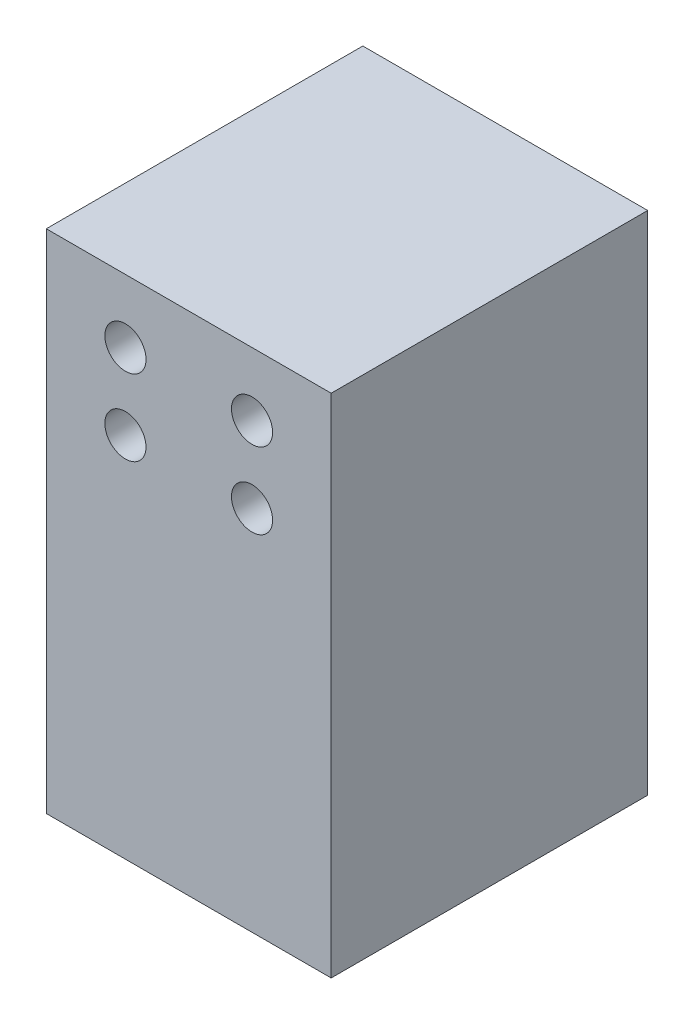
ISO-10303-21;
HEADER;
FILE_DESCRIPTION(('STEP AP214'),'2;1');
FILE_NAME('part.step','',(''),(''),'','','');
FILE_SCHEMA(('AUTOMOTIVE_DESIGN { 1 0 10303 214 1 1 1 1 }'));
ENDSEC;
DATA;
#1=APPLICATION_CONTEXT('core data for automotive mechanical design processes');
#2=APPLICATION_PROTOCOL_DEFINITION('international standard','automotive_design',2000,#1);
#3=PRODUCT_CONTEXT('',#1,'mechanical');
#4=PRODUCT('Part','Part','',(#3));
#5=PRODUCT_RELATED_PRODUCT_CATEGORY('part','',(#4));
#6=PRODUCT_DEFINITION_FORMATION('','',#4);
#7=PRODUCT_DEFINITION_CONTEXT('part definition',#1,'design');
#8=PRODUCT_DEFINITION('design','',#6,#7);
#9=PRODUCT_DEFINITION_SHAPE('','',#8);
#10=(LENGTH_UNIT() NAMED_UNIT(*) SI_UNIT(.MILLI.,.METRE.));
#11=(NAMED_UNIT(*) PLANE_ANGLE_UNIT() SI_UNIT($,.RADIAN.));
#12=(NAMED_UNIT(*) SI_UNIT($,.STERADIAN.) SOLID_ANGLE_UNIT());
#13=UNCERTAINTY_MEASURE_WITH_UNIT(LENGTH_MEASURE(1.E-05),#10,'distance_accuracy_value','');
#14=(GEOMETRIC_REPRESENTATION_CONTEXT(3) GLOBAL_UNCERTAINTY_ASSIGNED_CONTEXT((#13)) GLOBAL_UNIT_ASSIGNED_CONTEXT((#10,
#11,#12)) REPRESENTATION_CONTEXT('',''));
#15=CARTESIAN_POINT('',(0.,0.,0.));
#16=DIRECTION('',(0.,0.,1.));
#17=DIRECTION('',(1.,0.,0.));
#18=AXIS2_PLACEMENT_3D('',#15,#16,#17);
#19=CARTESIAN_POINT('',(22.5,-40.,25.));
#20=DIRECTION('',(-1.,0.,0.));
#21=DIRECTION('',(0.,0.,1.));
#22=AXIS2_PLACEMENT_3D('',#19,#20,#21);
#23=PLANE('',#22);
#24=DIRECTION('',(0.,1.,0.));
#25=VECTOR('',#24,1.);
#26=CARTESIAN_POINT('',(22.5,-40.,-25.));
#27=LINE('',#26,#25);
#28=CARTESIAN_POINT('',(22.5,-40.,-25.));
#29=VERTEX_POINT('',#28);
#30=CARTESIAN_POINT('',(22.5,40.,-25.));
#31=VERTEX_POINT('',#30);
#32=EDGE_CURVE('E95',#29,#31,#27,.T.);
#33=ORIENTED_EDGE('',*,*,#32,.T.);
#34=DIRECTION('',(0.,0.,-1.));
#35=VECTOR('',#34,1.);
#36=CARTESIAN_POINT('',(22.5,40.,25.));
#37=LINE('',#36,#35);
#38=CARTESIAN_POINT('',(22.5,40.,25.));
#39=VERTEX_POINT('',#38);
#40=EDGE_CURVE('E11',#39,#31,#37,.T.);
#41=ORIENTED_EDGE('',*,*,#40,.F.);
#42=DIRECTION('',(0.,1.,0.));
#43=VECTOR('',#42,1.);
#44=CARTESIAN_POINT('',(22.5,-40.,25.));
#45=LINE('',#44,#43);
#46=CARTESIAN_POINT('',(22.5,-40.,25.));
#47=VERTEX_POINT('',#46);
#48=EDGE_CURVE('E83',#47,#39,#45,.T.);
#49=ORIENTED_EDGE('',*,*,#48,.F.);
#50=DIRECTION('',(0.,0.,-1.));
#51=VECTOR('',#50,1.);
#52=CARTESIAN_POINT('',(22.5,-40.,25.));
#53=LINE('',#52,#51);
#54=EDGE_CURVE('E91',#47,#29,#53,.T.);
#55=ORIENTED_EDGE('',*,*,#54,.T.);
#56=EDGE_LOOP('',(#33,#41,#49,#55));
#57=FACE_BOUND('',#56,.T.);
#58=ADVANCED_FACE('F32',(#57),#23,.F.);
#59=CARTESIAN_POINT('',(-22.5,40.,25.));
#60=DIRECTION('',(0.,-1.,0.));
#61=DIRECTION('',(0.,0.,-1.));
#62=AXIS2_PLACEMENT_3D('',#59,#60,#61);
#63=PLANE('',#62);
#64=DIRECTION('',(-1.,0.,0.));
#65=VECTOR('',#64,1.);
#66=CARTESIAN_POINT('',(-22.5,40.,-25.));
#67=LINE('',#66,#65);
#68=CARTESIAN_POINT('',(-22.5,40.,-25.));
#69=VERTEX_POINT('',#68);
#70=EDGE_CURVE('E87',#31,#69,#67,.T.);
#71=ORIENTED_EDGE('',*,*,#70,.T.);
#72=DIRECTION('',(0.,0.,-1.));
#73=VECTOR('',#72,1.);
#74=CARTESIAN_POINT('',(-22.5,40.,25.));
#75=LINE('',#74,#73);
#76=CARTESIAN_POINT('',(-22.5,40.,25.));
#77=VERTEX_POINT('',#76);
#78=EDGE_CURVE('E40',#77,#69,#75,.T.);
#79=ORIENTED_EDGE('',*,*,#78,.F.);
#80=DIRECTION('',(-1.,0.,0.));
#81=VECTOR('',#80,1.);
#82=CARTESIAN_POINT('',(-22.5,40.,25.));
#83=LINE('',#82,#81);
#84=EDGE_CURVE('E78',#39,#77,#83,.T.);
#85=ORIENTED_EDGE('',*,*,#84,.F.);
#86=ORIENTED_EDGE('',*,*,#40,.T.);
#87=EDGE_LOOP('',(#71,#79,#85,#86));
#88=FACE_BOUND('',#87,.T.);
#89=ADVANCED_FACE('F86',(#88),#63,.F.);
#90=CARTESIAN_POINT('',(-22.5,-40.,25.));
#91=DIRECTION('',(1.,0.,0.));
#92=DIRECTION('',(0.,0.,-1.));
#93=AXIS2_PLACEMENT_3D('',#90,#91,#92);
#94=PLANE('',#93);
#95=DIRECTION('',(0.,-1.,0.));
#96=VECTOR('',#95,1.);
#97=CARTESIAN_POINT('',(-22.5,-40.,-25.));
#98=LINE('',#97,#96);
#99=CARTESIAN_POINT('',(-22.5,-40.,-25.));
#100=VERTEX_POINT('',#99);
#101=EDGE_CURVE('E65',#69,#100,#98,.T.);
#102=ORIENTED_EDGE('',*,*,#101,.T.);
#103=DIRECTION('',(0.,0.,-1.));
#104=VECTOR('',#103,1.);
#105=CARTESIAN_POINT('',(-22.5,-40.,25.));
#106=LINE('',#105,#104);
#107=CARTESIAN_POINT('',(-22.5,-40.,25.));
#108=VERTEX_POINT('',#107);
#109=EDGE_CURVE('E88',#108,#100,#106,.T.);
#110=ORIENTED_EDGE('',*,*,#109,.F.);
#111=DIRECTION('',(0.,-1.,0.));
#112=VECTOR('',#111,1.);
#113=CARTESIAN_POINT('',(-22.5,-40.,25.));
#114=LINE('',#113,#112);
#115=EDGE_CURVE('E81',#77,#108,#114,.T.);
#116=ORIENTED_EDGE('',*,*,#115,.F.);
#117=ORIENTED_EDGE('',*,*,#78,.T.);
#118=EDGE_LOOP('',(#102,#110,#116,#117));
#119=FACE_BOUND('',#118,.T.);
#120=ADVANCED_FACE('F89',(#119),#94,.F.);
#121=CARTESIAN_POINT('',(-22.5,-40.,25.));
#122=DIRECTION('',(0.,1.,0.));
#123=DIRECTION('',(0.,0.,1.));
#124=AXIS2_PLACEMENT_3D('',#121,#122,#123);
#125=PLANE('',#124);
#126=CARTESIAN_POINT('',(-12.,-40.,-17.5));
#127=DIRECTION('',(0.,-1.,0.));
#128=DIRECTION('',(0.,0.,-1.));
#129=AXIS2_PLACEMENT_3D('',#126,#127,#128);
#130=CIRCLE('',#129,2.25);
#131=CARTESIAN_POINT('',(-12.,-40.,-19.75));
#132=VERTEX_POINT('',#131);
#133=EDGE_CURVE('E142',#132,#132,#130,.T.);
#134=ORIENTED_EDGE('',*,*,#133,.F.);
#135=EDGE_LOOP('',(#134));
#136=FACE_BOUND('',#135,.T.);
#137=CARTESIAN_POINT('',(12.,-40.,-17.5));
#138=DIRECTION('',(0.,-1.,0.));
#139=DIRECTION('',(0.,0.,-1.));
#140=AXIS2_PLACEMENT_3D('',#137,#138,#139);
#141=CIRCLE('',#140,2.25);
#142=CARTESIAN_POINT('',(12.,-40.,-19.75));
#143=VERTEX_POINT('',#142);
#144=EDGE_CURVE('E148',#143,#143,#141,.T.);
#145=ORIENTED_EDGE('',*,*,#144,.F.);
#146=EDGE_LOOP('',(#145));
#147=FACE_BOUND('',#146,.T.);
#148=CARTESIAN_POINT('',(12.,-40.,17.5));
#149=DIRECTION('',(0.,-1.,0.));
#150=DIRECTION('',(0.,0.,-1.));
#151=AXIS2_PLACEMENT_3D('',#148,#149,#150);
#152=CIRCLE('',#151,2.25);
#153=CARTESIAN_POINT('',(12.,-40.,15.25));
#154=VERTEX_POINT('',#153);
#155=EDGE_CURVE('E136',#154,#154,#152,.T.);
#156=ORIENTED_EDGE('',*,*,#155,.F.);
#157=EDGE_LOOP('',(#156));
#158=FACE_BOUND('',#157,.T.);
#159=CARTESIAN_POINT('',(-12.,-40.,17.5));
#160=DIRECTION('',(0.,-1.,0.));
#161=DIRECTION('',(0.,0.,-1.));
#162=AXIS2_PLACEMENT_3D('',#159,#160,#161);
#163=CIRCLE('',#162,2.25);
#164=CARTESIAN_POINT('',(-12.,-40.,15.25));
#165=VERTEX_POINT('',#164);
#166=EDGE_CURVE('E133',#165,#165,#163,.T.);
#167=ORIENTED_EDGE('',*,*,#166,.F.);
#168=EDGE_LOOP('',(#167));
#169=FACE_BOUND('',#168,.T.);
#170=DIRECTION('',(1.,0.,0.));
#171=VECTOR('',#170,1.);
#172=CARTESIAN_POINT('',(-22.5,-40.,-25.));
#173=LINE('',#172,#171);
#174=EDGE_CURVE('E71',#100,#29,#173,.T.);
#175=ORIENTED_EDGE('',*,*,#174,.T.);
#176=ORIENTED_EDGE('',*,*,#54,.F.);
#177=DIRECTION('',(1.,0.,0.));
#178=VECTOR('',#177,1.);
#179=CARTESIAN_POINT('',(-22.5,-40.,25.));
#180=LINE('',#179,#178);
#181=EDGE_CURVE('E48',#108,#47,#180,.T.);
#182=ORIENTED_EDGE('',*,*,#181,.F.);
#183=ORIENTED_EDGE('',*,*,#109,.T.);
#184=EDGE_LOOP('',(#175,#176,#182,#183));
#185=FACE_BOUND('',#184,.T.);
#186=ADVANCED_FACE('F103',(#136,#147,#158,#169,#185),#125,.F.);
#187=CARTESIAN_POINT('',(0.,0.,25.));
#188=DIRECTION('',(0.,0.,-1.));
#189=DIRECTION('',(-1.,0.,0.));
#190=AXIS2_PLACEMENT_3D('',#187,#188,#189);
#191=PLANE('',#190);
#192=CARTESIAN_POINT('',(-9.99999999999999,18.,25.));
#193=DIRECTION('',(0.,0.,1.));
#194=DIRECTION('',(1.,0.,0.));
#195=AXIS2_PLACEMENT_3D('',#192,#193,#194);
#196=CIRCLE('',#195,3.25);
#197=CARTESIAN_POINT('',(-6.74999999999999,18.,25.));
#198=VERTEX_POINT('',#197);
#199=EDGE_CURVE('E124',#198,#198,#196,.T.);
#200=ORIENTED_EDGE('',*,*,#199,.F.);
#201=EDGE_LOOP('',(#200));
#202=FACE_BOUND('',#201,.T.);
#203=CARTESIAN_POINT('',(9.99999999999999,18.,25.));
#204=DIRECTION('',(0.,0.,1.));
#205=DIRECTION('',(1.,0.,0.));
#206=AXIS2_PLACEMENT_3D('',#203,#204,#205);
#207=CIRCLE('',#206,3.25);
#208=CARTESIAN_POINT('',(13.25,18.,25.));
#209=VERTEX_POINT('',#208);
#210=EDGE_CURVE('E125',#209,#209,#207,.T.);
#211=ORIENTED_EDGE('',*,*,#210,.F.);
#212=EDGE_LOOP('',(#211));
#213=FACE_BOUND('',#212,.T.);
#214=CARTESIAN_POINT('',(-9.99999999999999,30.,25.));
#215=DIRECTION('',(0.,0.,1.));
#216=DIRECTION('',(1.,0.,0.));
#217=AXIS2_PLACEMENT_3D('',#214,#215,#216);
#218=CIRCLE('',#217,3.25);
#219=CARTESIAN_POINT('',(-6.74999999999999,30.,25.));
#220=VERTEX_POINT('',#219);
#221=EDGE_CURVE('E112',#220,#220,#218,.T.);
#222=ORIENTED_EDGE('',*,*,#221,.F.);
#223=EDGE_LOOP('',(#222));
#224=FACE_BOUND('',#223,.T.);
#225=CARTESIAN_POINT('',(9.99999999999999,30.,25.));
#226=DIRECTION('',(0.,0.,1.));
#227=DIRECTION('',(1.,0.,0.));
#228=AXIS2_PLACEMENT_3D('',#225,#226,#227);
#229=CIRCLE('',#228,3.25);
#230=CARTESIAN_POINT('',(13.25,30.,25.));
#231=VERTEX_POINT('',#230);
#232=EDGE_CURVE('E109',#231,#231,#229,.T.);
#233=ORIENTED_EDGE('',*,*,#232,.F.);
#234=EDGE_LOOP('',(#233));
#235=FACE_BOUND('',#234,.T.);
#236=ORIENTED_EDGE('',*,*,#48,.T.);
#237=ORIENTED_EDGE('',*,*,#84,.T.);
#238=ORIENTED_EDGE('',*,*,#115,.T.);
#239=ORIENTED_EDGE('',*,*,#181,.T.);
#240=EDGE_LOOP('',(#236,#237,#238,#239));
#241=FACE_BOUND('',#240,.T.);
#242=ADVANCED_FACE('F79',(#202,#213,#224,#235,#241),#191,.F.);
#243=CARTESIAN_POINT('',(0.,0.,-25.));
#244=DIRECTION('',(0.,0.,-1.));
#245=DIRECTION('',(-1.,0.,0.));
#246=AXIS2_PLACEMENT_3D('',#243,#244,#245);
#247=PLANE('',#246);
#248=CARTESIAN_POINT('',(-9.99999999999999,18.,-25.));
#249=DIRECTION('',(0.,0.,1.));
#250=DIRECTION('',(1.,0.,0.));
#251=AXIS2_PLACEMENT_3D('',#248,#249,#250);
#252=CIRCLE('',#251,3.25);
#253=CARTESIAN_POINT('',(-6.74999999999999,18.,-25.));
#254=VERTEX_POINT('',#253);
#255=EDGE_CURVE('E116',#254,#254,#252,.T.);
#256=ORIENTED_EDGE('',*,*,#255,.T.);
#257=EDGE_LOOP('',(#256));
#258=FACE_BOUND('',#257,.T.);
#259=CARTESIAN_POINT('',(9.99999999999999,18.,-25.));
#260=DIRECTION('',(0.,0.,1.));
#261=DIRECTION('',(1.,0.,0.));
#262=AXIS2_PLACEMENT_3D('',#259,#260,#261);
#263=CIRCLE('',#262,3.25);
#264=CARTESIAN_POINT('',(13.25,18.,-25.));
#265=VERTEX_POINT('',#264);
#266=EDGE_CURVE('E121',#265,#265,#263,.T.);
#267=ORIENTED_EDGE('',*,*,#266,.T.);
#268=EDGE_LOOP('',(#267));
#269=FACE_BOUND('',#268,.T.);
#270=CARTESIAN_POINT('',(-9.99999999999999,30.,-25.));
#271=DIRECTION('',(0.,0.,1.));
#272=DIRECTION('',(1.,0.,0.));
#273=AXIS2_PLACEMENT_3D('',#270,#271,#272);
#274=CIRCLE('',#273,3.25);
#275=CARTESIAN_POINT('',(-6.74999999999999,30.,-25.));
#276=VERTEX_POINT('',#275);
#277=EDGE_CURVE('E98',#276,#276,#274,.T.);
#278=ORIENTED_EDGE('',*,*,#277,.T.);
#279=EDGE_LOOP('',(#278));
#280=FACE_BOUND('',#279,.T.);
#281=CARTESIAN_POINT('',(9.99999999999999,30.,-25.));
#282=DIRECTION('',(0.,0.,1.));
#283=DIRECTION('',(1.,0.,0.));
#284=AXIS2_PLACEMENT_3D('',#281,#282,#283);
#285=CIRCLE('',#284,3.25);
#286=CARTESIAN_POINT('',(13.25,30.,-25.));
#287=VERTEX_POINT('',#286);
#288=EDGE_CURVE('E113',#287,#287,#285,.T.);
#289=ORIENTED_EDGE('',*,*,#288,.T.);
#290=EDGE_LOOP('',(#289));
#291=FACE_BOUND('',#290,.T.);
#292=ORIENTED_EDGE('',*,*,#32,.F.);
#293=ORIENTED_EDGE('',*,*,#174,.F.);
#294=ORIENTED_EDGE('',*,*,#101,.F.);
#295=ORIENTED_EDGE('',*,*,#70,.F.);
#296=EDGE_LOOP('',(#292,#293,#294,#295));
#297=FACE_BOUND('',#296,.T.);
#298=ADVANCED_FACE('F106',(#258,#269,#280,#291,#297),#247,.T.);
#299=CARTESIAN_POINT('',(9.99999999999999,30.,-25.));
#300=DIRECTION('',(0.,0.,1.));
#301=DIRECTION('',(1.,0.,0.));
#302=AXIS2_PLACEMENT_3D('',#299,#300,#301);
#303=CYLINDRICAL_SURFACE('',#302,3.25);
#304=ORIENTED_EDGE('',*,*,#288,.F.);
#305=EDGE_LOOP('',(#304));
#306=FACE_BOUND('',#305,.T.);
#307=ORIENTED_EDGE('',*,*,#232,.T.);
#308=EDGE_LOOP('',(#307));
#309=FACE_BOUND('',#308,.T.);
#310=ADVANCED_FACE('F192',(#306,#309),#303,.F.);
#311=CARTESIAN_POINT('',(-9.99999999999999,30.,-25.));
#312=DIRECTION('',(0.,0.,1.));
#313=DIRECTION('',(1.,0.,0.));
#314=AXIS2_PLACEMENT_3D('',#311,#312,#313);
#315=CYLINDRICAL_SURFACE('',#314,3.25);
#316=ORIENTED_EDGE('',*,*,#277,.F.);
#317=EDGE_LOOP('',(#316));
#318=FACE_BOUND('',#317,.T.);
#319=ORIENTED_EDGE('',*,*,#221,.T.);
#320=EDGE_LOOP('',(#319));
#321=FACE_BOUND('',#320,.T.);
#322=ADVANCED_FACE('F199',(#318,#321),#315,.F.);
#323=CARTESIAN_POINT('',(9.99999999999999,18.,-25.));
#324=DIRECTION('',(0.,0.,1.));
#325=DIRECTION('',(1.,0.,0.));
#326=AXIS2_PLACEMENT_3D('',#323,#324,#325);
#327=CYLINDRICAL_SURFACE('',#326,3.25);
#328=ORIENTED_EDGE('',*,*,#266,.F.);
#329=EDGE_LOOP('',(#328));
#330=FACE_BOUND('',#329,.T.);
#331=ORIENTED_EDGE('',*,*,#210,.T.);
#332=EDGE_LOOP('',(#331));
#333=FACE_BOUND('',#332,.T.);
#334=ADVANCED_FACE('F177',(#330,#333),#327,.F.);
#335=CARTESIAN_POINT('',(-9.99999999999999,18.,-25.));
#336=DIRECTION('',(0.,0.,1.));
#337=DIRECTION('',(1.,0.,0.));
#338=AXIS2_PLACEMENT_3D('',#335,#336,#337);
#339=CYLINDRICAL_SURFACE('',#338,3.25);
#340=ORIENTED_EDGE('',*,*,#255,.F.);
#341=EDGE_LOOP('',(#340));
#342=FACE_BOUND('',#341,.T.);
#343=ORIENTED_EDGE('',*,*,#199,.T.);
#344=EDGE_LOOP('',(#343));
#345=FACE_BOUND('',#344,.T.);
#346=ADVANCED_FACE('F168',(#342,#345),#339,.F.);
#347=CARTESIAN_POINT('',(-12.,-25.,17.5));
#348=DIRECTION('',(0.,-1.,0.));
#349=DIRECTION('',(0.,0.,-1.));
#350=AXIS2_PLACEMENT_3D('',#347,#348,#349);
#351=CYLINDRICAL_SURFACE('',#350,2.25);
#352=CARTESIAN_POINT('',(-12.,-25.,17.5));
#353=DIRECTION('',(0.,-1.,0.));
#354=DIRECTION('',(0.,0.,-1.));
#355=AXIS2_PLACEMENT_3D('',#352,#353,#354);
#356=CIRCLE('',#355,2.25);
#357=CARTESIAN_POINT('',(-12.,-25.,15.25));
#358=VERTEX_POINT('',#357);
#359=EDGE_CURVE('E128',#358,#358,#356,.T.);
#360=ORIENTED_EDGE('',*,*,#359,.F.);
#361=EDGE_LOOP('',(#360));
#362=FACE_BOUND('',#361,.T.);
#363=ORIENTED_EDGE('',*,*,#166,.T.);
#364=EDGE_LOOP('',(#363));
#365=FACE_BOUND('',#364,.T.);
#366=ADVANCED_FACE('F165',(#362,#365),#351,.F.);
#367=CARTESIAN_POINT('',(-12.,-25.,17.5));
#368=DIRECTION('',(0.,-1.,0.));
#369=DIRECTION('',(0.,0.,-1.));
#370=AXIS2_PLACEMENT_3D('',#367,#368,#369);
#371=PLANE('',#370);
#372=ORIENTED_EDGE('',*,*,#359,.T.);
#373=EDGE_LOOP('',(#372));
#374=FACE_BOUND('',#373,.T.);
#375=ADVANCED_FACE('F167',(#374),#371,.T.);
#376=CARTESIAN_POINT('',(12.,-25.,17.5));
#377=DIRECTION('',(0.,-1.,0.));
#378=DIRECTION('',(0.,0.,-1.));
#379=AXIS2_PLACEMENT_3D('',#376,#377,#378);
#380=CYLINDRICAL_SURFACE('',#379,2.25);
#381=CARTESIAN_POINT('',(12.,-25.,17.5));
#382=DIRECTION('',(0.,-1.,0.));
#383=DIRECTION('',(0.,0.,-1.));
#384=AXIS2_PLACEMENT_3D('',#381,#382,#383);
#385=CIRCLE('',#384,2.25);
#386=CARTESIAN_POINT('',(12.,-25.,15.25));
#387=VERTEX_POINT('',#386);
#388=EDGE_CURVE('E151',#387,#387,#385,.T.);
#389=ORIENTED_EDGE('',*,*,#388,.F.);
#390=EDGE_LOOP('',(#389));
#391=FACE_BOUND('',#390,.T.);
#392=ORIENTED_EDGE('',*,*,#155,.T.);
#393=EDGE_LOOP('',(#392));
#394=FACE_BOUND('',#393,.T.);
#395=ADVANCED_FACE('F157',(#391,#394),#380,.F.);
#396=CARTESIAN_POINT('',(12.,-25.,17.5));
#397=DIRECTION('',(0.,-1.,0.));
#398=DIRECTION('',(0.,0.,-1.));
#399=AXIS2_PLACEMENT_3D('',#396,#397,#398);
#400=PLANE('',#399);
#401=ORIENTED_EDGE('',*,*,#388,.T.);
#402=EDGE_LOOP('',(#401));
#403=FACE_BOUND('',#402,.T.);
#404=ADVANCED_FACE('F257',(#403),#400,.T.);
#405=CARTESIAN_POINT('',(12.,-25.,-17.5));
#406=DIRECTION('',(0.,-1.,0.));
#407=DIRECTION('',(0.,0.,-1.));
#408=AXIS2_PLACEMENT_3D('',#405,#406,#407);
#409=CYLINDRICAL_SURFACE('',#408,2.25);
#410=CARTESIAN_POINT('',(12.,-25.,-17.5));
#411=DIRECTION('',(0.,-1.,0.));
#412=DIRECTION('',(0.,0.,-1.));
#413=AXIS2_PLACEMENT_3D('',#410,#411,#412);
#414=CIRCLE('',#413,2.25);
#415=CARTESIAN_POINT('',(12.,-25.,-19.75));
#416=VERTEX_POINT('',#415);
#417=EDGE_CURVE('E145',#416,#416,#414,.T.);
#418=ORIENTED_EDGE('',*,*,#417,.F.);
#419=EDGE_LOOP('',(#418));
#420=FACE_BOUND('',#419,.T.);
#421=ORIENTED_EDGE('',*,*,#144,.T.);
#422=EDGE_LOOP('',(#421));
#423=FACE_BOUND('',#422,.T.);
#424=ADVANCED_FACE('F267',(#420,#423),#409,.F.);
#425=CARTESIAN_POINT('',(12.,-25.,-17.5));
#426=DIRECTION('',(0.,-1.,0.));
#427=DIRECTION('',(0.,0.,-1.));
#428=AXIS2_PLACEMENT_3D('',#425,#426,#427);
#429=PLANE('',#428);
#430=ORIENTED_EDGE('',*,*,#417,.T.);
#431=EDGE_LOOP('',(#430));
#432=FACE_BOUND('',#431,.T.);
#433=ADVANCED_FACE('F277',(#432),#429,.T.);
#434=CARTESIAN_POINT('',(-12.,-25.,-17.5));
#435=DIRECTION('',(0.,-1.,0.));
#436=DIRECTION('',(0.,0.,-1.));
#437=AXIS2_PLACEMENT_3D('',#434,#435,#436);
#438=CYLINDRICAL_SURFACE('',#437,2.25);
#439=CARTESIAN_POINT('',(-12.,-25.,-17.5));
#440=DIRECTION('',(0.,-1.,0.));
#441=DIRECTION('',(0.,0.,-1.));
#442=AXIS2_PLACEMENT_3D('',#439,#440,#441);
#443=CIRCLE('',#442,2.25);
#444=CARTESIAN_POINT('',(-12.,-25.,-19.75));
#445=VERTEX_POINT('',#444);
#446=EDGE_CURVE('E139',#445,#445,#443,.T.);
#447=ORIENTED_EDGE('',*,*,#446,.F.);
#448=EDGE_LOOP('',(#447));
#449=FACE_BOUND('',#448,.T.);
#450=ORIENTED_EDGE('',*,*,#133,.T.);
#451=EDGE_LOOP('',(#450));
#452=FACE_BOUND('',#451,.T.);
#453=ADVANCED_FACE('F287',(#449,#452),#438,.F.);
#454=CARTESIAN_POINT('',(-12.,-25.,-17.5));
#455=DIRECTION('',(0.,-1.,0.));
#456=DIRECTION('',(0.,0.,-1.));
#457=AXIS2_PLACEMENT_3D('',#454,#455,#456);
#458=PLANE('',#457);
#459=ORIENTED_EDGE('',*,*,#446,.T.);
#460=EDGE_LOOP('',(#459));
#461=FACE_BOUND('',#460,.T.);
#462=ADVANCED_FACE('F297',(#461),#458,.T.);
#463=CLOSED_SHELL('',(#58,#89,#120,#186,#242,#298,#310,#322,#334,#346,#366,#375,#395,#404,#424,
#433,#453,#462));
#464=MANIFOLD_SOLID_BREP('B2',#463);
#465=ADVANCED_BREP_SHAPE_REPRESENTATION('',(#18,#464),#14);
#466=SHAPE_DEFINITION_REPRESENTATION(#9,#465);
ENDSEC;
END-ISO-10303-21;
